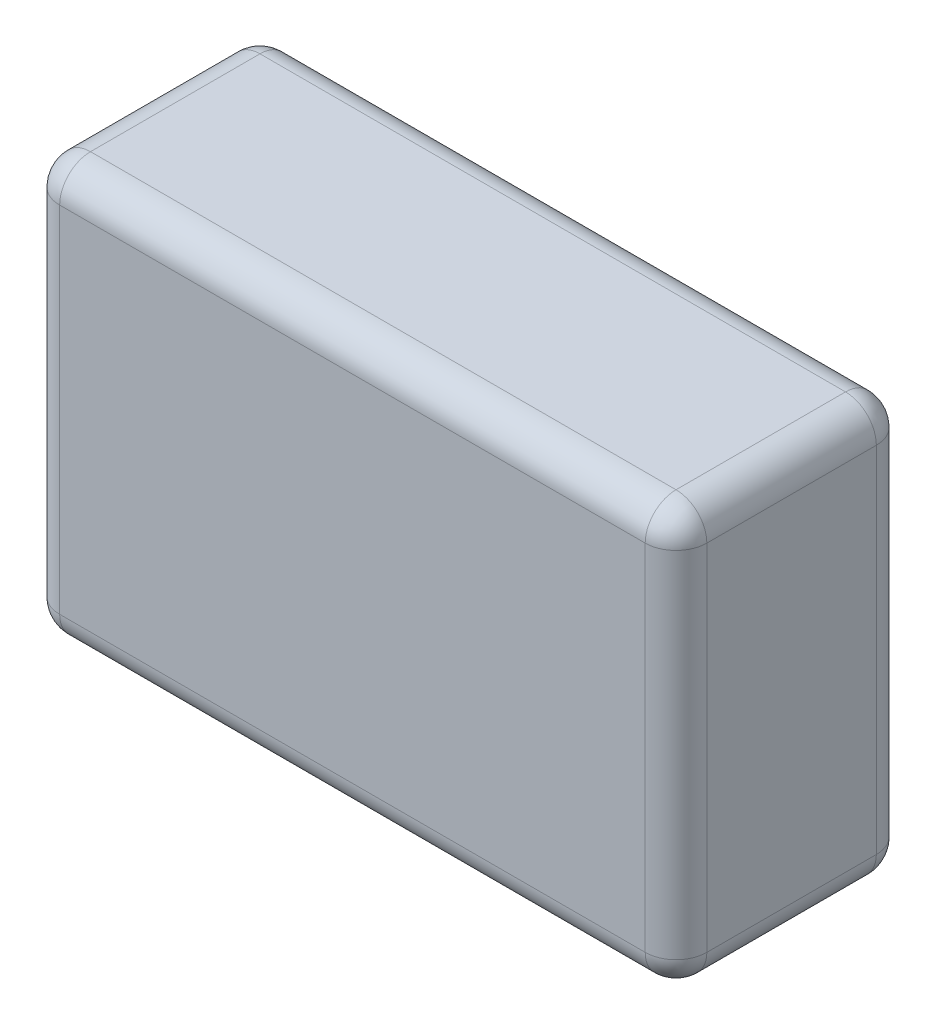
ISO-10303-21;
HEADER;
FILE_DESCRIPTION(('STEP AP214'),'2;1');
FILE_NAME('part.step','',(''),(''),'','','');
FILE_SCHEMA(('AUTOMOTIVE_DESIGN { 1 0 10303 214 1 1 1 1 }'));
ENDSEC;
DATA;
#1=APPLICATION_CONTEXT('core data for automotive mechanical design processes');
#2=APPLICATION_PROTOCOL_DEFINITION('international standard','automotive_design',2000,#1);
#3=PRODUCT_CONTEXT('',#1,'mechanical');
#4=PRODUCT('Part','Part','',(#3));
#5=PRODUCT_RELATED_PRODUCT_CATEGORY('part','',(#4));
#6=PRODUCT_DEFINITION_FORMATION('','',#4);
#7=PRODUCT_DEFINITION_CONTEXT('part definition',#1,'design');
#8=PRODUCT_DEFINITION('design','',#6,#7);
#9=PRODUCT_DEFINITION_SHAPE('','',#8);
#10=(LENGTH_UNIT() NAMED_UNIT(*) SI_UNIT(.MILLI.,.METRE.));
#11=(NAMED_UNIT(*) PLANE_ANGLE_UNIT() SI_UNIT($,.RADIAN.));
#12=(NAMED_UNIT(*) SI_UNIT($,.STERADIAN.) SOLID_ANGLE_UNIT());
#13=UNCERTAINTY_MEASURE_WITH_UNIT(LENGTH_MEASURE(1.E-05),#10,'distance_accuracy_value','');
#14=(GEOMETRIC_REPRESENTATION_CONTEXT(3) GLOBAL_UNCERTAINTY_ASSIGNED_CONTEXT((#13)) GLOBAL_UNIT_ASSIGNED_CONTEXT((#10,
#11,#12)) REPRESENTATION_CONTEXT('',''));
#15=CARTESIAN_POINT('',(0.,0.,0.));
#16=DIRECTION('',(0.,0.,1.));
#17=DIRECTION('',(1.,0.,0.));
#18=AXIS2_PLACEMENT_3D('',#15,#16,#17);
#19=CARTESIAN_POINT('',(0.95,-0.975,0.1));
#20=DIRECTION('',(0.,-1.,0.));
#21=DIRECTION('',(0.,0.,-1.));
#22=AXIS2_PLACEMENT_3D('',#19,#20,#21);
#23=CYLINDRICAL_SURFACE('',#22,0.1);
#24=DIRECTION('',(0.,1.,0.));
#25=VECTOR('',#24,1.);
#26=CARTESIAN_POINT('',(0.95,-0.675,0.));
#27=LINE('',#26,#25);
#28=CARTESIAN_POINT('',(0.95,0.575000000050173,0.));
#29=VERTEX_POINT('',#28);
#30=CARTESIAN_POINT('',(0.95,-0.575,0.));
#31=VERTEX_POINT('',#30);
#32=EDGE_CURVE('E120',#29,#31,#27,.F.);
#33=ORIENTED_EDGE('',*,*,#32,.F.);
#34=CARTESIAN_POINT('',(0.95,0.575,0.1));
#35=DIRECTION('',(0.,1.,0.));
#36=DIRECTION('',(1.,0.,0.));
#37=AXIS2_PLACEMENT_3D('',#34,#35,#36);
#38=CIRCLE('',#37,0.0999999999999999);
#39=CARTESIAN_POINT('',(1.05,0.575,0.1));
#40=VERTEX_POINT('',#39);
#41=EDGE_CURVE('E237',#40,#29,#38,.T.);
#42=ORIENTED_EDGE('',*,*,#41,.F.);
#43=DIRECTION('',(0.,1.,0.));
#44=VECTOR('',#43,1.);
#45=CARTESIAN_POINT('',(1.05,-0.675,0.1));
#46=LINE('',#45,#44);
#47=CARTESIAN_POINT('',(1.05,-0.575,0.1));
#48=VERTEX_POINT('',#47);
#49=EDGE_CURVE('E123',#48,#40,#46,.T.);
#50=ORIENTED_EDGE('',*,*,#49,.F.);
#51=CARTESIAN_POINT('',(0.95,-0.575,0.1));
#52=DIRECTION('',(0.,1.,0.));
#53=DIRECTION('',(1.,0.,0.));
#54=AXIS2_PLACEMENT_3D('',#51,#52,#53);
#55=CIRCLE('',#54,0.1);
#56=EDGE_CURVE('E119',#31,#48,#55,.F.);
#57=ORIENTED_EDGE('',*,*,#56,.F.);
#58=EDGE_LOOP('',(#33,#42,#50,#57));
#59=FACE_BOUND('',#58,.T.);
#60=ADVANCED_FACE('F16',(#59),#23,.T.);
#61=CARTESIAN_POINT('',(0.95,0.575,0.1));
#62=DIRECTION('',(0.,1.,0.));
#63=DIRECTION('',(1.,0.,0.));
#64=AXIS2_PLACEMENT_3D('',#61,#62,#63);
#65=SPHERICAL_SURFACE('',#64,0.1);
#66=CARTESIAN_POINT('',(0.95,0.575,0.1));
#67=DIRECTION('',(-1.,0.,0.));
#68=DIRECTION('',(0.,0.,1.));
#69=AXIS2_PLACEMENT_3D('',#66,#67,#68);
#70=CIRCLE('',#69,0.1);
#71=CARTESIAN_POINT('',(0.95,0.675,0.1));
#72=VERTEX_POINT('',#71);
#73=EDGE_CURVE('E185',#72,#29,#70,.T.);
#74=ORIENTED_EDGE('',*,*,#73,.F.);
#75=CARTESIAN_POINT('',(0.95,0.575,0.1));
#76=DIRECTION('',(0.,0.,-1.));
#77=DIRECTION('',(-1.,0.,0.));
#78=AXIS2_PLACEMENT_3D('',#75,#76,#77);
#79=CIRCLE('',#78,0.1);
#80=EDGE_CURVE('E192',#40,#72,#79,.F.);
#81=ORIENTED_EDGE('',*,*,#80,.F.);
#82=ORIENTED_EDGE('',*,*,#41,.T.);
#83=EDGE_LOOP('',(#74,#81,#82));
#84=FACE_BOUND('',#83,.T.);
#85=ADVANCED_FACE('F246',(#84),#65,.T.);
#86=CARTESIAN_POINT('',(-0.95,0.575,0.1));
#87=DIRECTION('',(-1.,0.,0.));
#88=DIRECTION('',(0.,1.,0.));
#89=AXIS2_PLACEMENT_3D('',#86,#87,#88);
#90=SPHERICAL_SURFACE('',#89,0.1);
#91=CARTESIAN_POINT('',(-0.95,0.575,0.1));
#92=DIRECTION('',(0.,-1.,0.));
#93=DIRECTION('',(0.,0.,-1.));
#94=AXIS2_PLACEMENT_3D('',#91,#92,#93);
#95=CIRCLE('',#94,0.1);
#96=CARTESIAN_POINT('',(-1.05,0.575,0.1));
#97=VERTEX_POINT('',#96);
#98=CARTESIAN_POINT('',(-0.95,0.575000000100311,0.));
#99=VERTEX_POINT('',#98);
#100=EDGE_CURVE('E132',#97,#99,#95,.T.);
#101=ORIENTED_EDGE('',*,*,#100,.F.);
#102=CARTESIAN_POINT('',(-0.95,0.575,0.1));
#103=DIRECTION('',(0.,0.,1.));
#104=DIRECTION('',(1.,0.,0.));
#105=AXIS2_PLACEMENT_3D('',#102,#103,#104);
#106=CIRCLE('',#105,0.1);
#107=CARTESIAN_POINT('',(-0.95,0.675,0.100000000194307));
#108=VERTEX_POINT('',#107);
#109=EDGE_CURVE('E177',#108,#97,#106,.T.);
#110=ORIENTED_EDGE('',*,*,#109,.F.);
#111=CARTESIAN_POINT('',(-0.95,0.575,0.0999999999999999));
#112=DIRECTION('',(-1.,0.,0.));
#113=DIRECTION('',(0.,0.,1.));
#114=AXIS2_PLACEMENT_3D('',#111,#112,#113);
#115=CIRCLE('',#114,0.1);
#116=EDGE_CURVE('E182',#99,#108,#115,.F.);
#117=ORIENTED_EDGE('',*,*,#116,.F.);
#118=EDGE_LOOP('',(#101,#110,#117));
#119=FACE_BOUND('',#118,.T.);
#120=ADVANCED_FACE('F244',(#119),#90,.T.);
#121=CARTESIAN_POINT('',(-0.95,-0.975,0.1));
#122=DIRECTION('',(0.,-1.,0.));
#123=DIRECTION('',(0.,0.,-1.));
#124=AXIS2_PLACEMENT_3D('',#121,#122,#123);
#125=CYLINDRICAL_SURFACE('',#124,0.1);
#126=DIRECTION('',(0.,1.,0.));
#127=VECTOR('',#126,1.);
#128=CARTESIAN_POINT('',(-1.05,-0.675,0.1));
#129=LINE('',#128,#127);
#130=CARTESIAN_POINT('',(-1.05,-0.575,0.1));
#131=VERTEX_POINT('',#130);
#132=EDGE_CURVE('E174',#97,#131,#129,.F.);
#133=ORIENTED_EDGE('',*,*,#132,.F.);
#134=ORIENTED_EDGE('',*,*,#100,.T.);
#135=DIRECTION('',(0.,1.,0.));
#136=VECTOR('',#135,1.);
#137=CARTESIAN_POINT('',(-0.95,-0.675,0.));
#138=LINE('',#137,#136);
#139=CARTESIAN_POINT('',(-0.95,-0.575000000100196,0.));
#140=VERTEX_POINT('',#139);
#141=EDGE_CURVE('E101',#140,#99,#138,.T.);
#142=ORIENTED_EDGE('',*,*,#141,.F.);
#143=CARTESIAN_POINT('',(-0.95,-0.575,0.0999999999999999));
#144=DIRECTION('',(0.,-1.,0.));
#145=DIRECTION('',(-1.,0.,0.));
#146=AXIS2_PLACEMENT_3D('',#143,#144,#145);
#147=CIRCLE('',#146,0.0999999999999999);
#148=EDGE_CURVE('E207',#131,#140,#147,.T.);
#149=ORIENTED_EDGE('',*,*,#148,.F.);
#150=EDGE_LOOP('',(#133,#134,#142,#149));
#151=FACE_BOUND('',#150,.T.);
#152=ADVANCED_FACE('F222',(#151),#125,.T.);
#153=CARTESIAN_POINT('',(0.95,-0.575,0.1));
#154=DIRECTION('',(1.,0.,0.));
#155=DIRECTION('',(0.,-1.,0.));
#156=AXIS2_PLACEMENT_3D('',#153,#154,#155);
#157=SPHERICAL_SURFACE('',#156,0.1);
#158=CARTESIAN_POINT('',(0.95,-0.575,0.1));
#159=DIRECTION('',(1.,0.,0.));
#160=DIRECTION('',(0.,0.,-1.));
#161=AXIS2_PLACEMENT_3D('',#158,#159,#160);
#162=CIRCLE('',#161,0.1);
#163=CARTESIAN_POINT('',(0.95,-0.675,0.1));
#164=VERTEX_POINT('',#163);
#165=EDGE_CURVE('E112',#31,#164,#162,.F.);
#166=ORIENTED_EDGE('',*,*,#165,.F.);
#167=ORIENTED_EDGE('',*,*,#56,.T.);
#168=CARTESIAN_POINT('',(0.95,-0.575,0.1));
#169=DIRECTION('',(0.,0.,1.));
#170=DIRECTION('',(1.,0.,0.));
#171=AXIS2_PLACEMENT_3D('',#168,#169,#170);
#172=CIRCLE('',#171,0.1);
#173=EDGE_CURVE('E136',#164,#48,#172,.T.);
#174=ORIENTED_EDGE('',*,*,#173,.F.);
#175=EDGE_LOOP('',(#166,#167,#174));
#176=FACE_BOUND('',#175,.T.);
#177=ADVANCED_FACE('F134',(#176),#157,.T.);
#178=CARTESIAN_POINT('',(1.05,-0.675,0.));
#179=DIRECTION('',(0.,0.,-1.));
#180=DIRECTION('',(-1.,0.,0.));
#181=AXIS2_PLACEMENT_3D('',#178,#179,#180);
#182=PLANE('',#181);
#183=ORIENTED_EDGE('',*,*,#32,.T.);
#184=DIRECTION('',(-1.,0.,0.));
#185=VECTOR('',#184,1.);
#186=CARTESIAN_POINT('',(1.05,-0.575000000200392,0.));
#187=LINE('',#186,#185);
#188=EDGE_CURVE('E19',#140,#31,#187,.F.);
#189=ORIENTED_EDGE('',*,*,#188,.F.);
#190=ORIENTED_EDGE('',*,*,#141,.T.);
#191=DIRECTION('',(-1.,0.,0.));
#192=VECTOR('',#191,1.);
#193=CARTESIAN_POINT('',(1.35,0.575,0.));
#194=LINE('',#193,#192);
#195=EDGE_CURVE('E130',#29,#99,#194,.T.);
#196=ORIENTED_EDGE('',*,*,#195,.F.);
#197=EDGE_LOOP('',(#183,#189,#190,#196));
#198=FACE_BOUND('',#197,.T.);
#199=ADVANCED_FACE('F129',(#198),#182,.T.);
#200=CARTESIAN_POINT('',(-0.95,-0.575,0.0999999999999999));
#201=DIRECTION('',(0.,-1.,0.));
#202=DIRECTION('',(-1.,0.,0.));
#203=AXIS2_PLACEMENT_3D('',#200,#201,#202);
#204=SPHERICAL_SURFACE('',#203,0.1);
#205=CARTESIAN_POINT('',(-0.95,-0.575,0.1));
#206=DIRECTION('',(0.,0.,-1.));
#207=DIRECTION('',(-1.,0.,0.));
#208=AXIS2_PLACEMENT_3D('',#205,#206,#207);
#209=CIRCLE('',#208,0.1);
#210=CARTESIAN_POINT('',(-0.95,-0.675,0.100000000300902));
#211=VERTEX_POINT('',#210);
#212=EDGE_CURVE('E116',#131,#211,#209,.F.);
#213=ORIENTED_EDGE('',*,*,#212,.F.);
#214=ORIENTED_EDGE('',*,*,#148,.T.);
#215=CARTESIAN_POINT('',(-0.95,-0.575,0.0999999999999999));
#216=DIRECTION('',(1.,0.,0.));
#217=DIRECTION('',(0.,0.,-1.));
#218=AXIS2_PLACEMENT_3D('',#215,#216,#217);
#219=CIRCLE('',#218,0.1);
#220=EDGE_CURVE('E113',#211,#140,#219,.T.);
#221=ORIENTED_EDGE('',*,*,#220,.F.);
#222=EDGE_LOOP('',(#213,#214,#221));
#223=FACE_BOUND('',#222,.T.);
#224=ADVANCED_FACE('F210',(#223),#204,.T.);
#225=CARTESIAN_POINT('',(1.05,-0.675,0.75));
#226=DIRECTION('',(1.,0.,0.));
#227=DIRECTION('',(0.,0.,-1.));
#228=AXIS2_PLACEMENT_3D('',#225,#226,#227);
#229=PLANE('',#228);
#230=DIRECTION('',(0.,-1.,0.));
#231=VECTOR('',#230,1.);
#232=CARTESIAN_POINT('',(1.05,-0.975,0.65));
#233=LINE('',#232,#231);
#234=CARTESIAN_POINT('',(1.05,-0.575,0.65));
#235=VERTEX_POINT('',#234);
#236=CARTESIAN_POINT('',(1.05,0.575,0.65));
#237=VERTEX_POINT('',#236);
#238=EDGE_CURVE('E151',#235,#237,#233,.F.);
#239=ORIENTED_EDGE('',*,*,#238,.F.);
#240=DIRECTION('',(0.,0.,1.));
#241=VECTOR('',#240,1.);
#242=CARTESIAN_POINT('',(1.05,-0.575,1.15));
#243=LINE('',#242,#241);
#244=EDGE_CURVE('E138',#48,#235,#243,.T.);
#245=ORIENTED_EDGE('',*,*,#244,.F.);
#246=ORIENTED_EDGE('',*,*,#49,.T.);
#247=DIRECTION('',(0.,0.,-1.));
#248=VECTOR('',#247,1.);
#249=CARTESIAN_POINT('',(1.05,0.575,1.15));
#250=LINE('',#249,#248);
#251=EDGE_CURVE('E186',#237,#40,#250,.T.);
#252=ORIENTED_EDGE('',*,*,#251,.F.);
#253=EDGE_LOOP('',(#239,#245,#246,#252));
#254=FACE_BOUND('',#253,.T.);
#255=ADVANCED_FACE('F214',(#254),#229,.T.);
#256=CARTESIAN_POINT('',(0.95,0.575,1.15));
#257=DIRECTION('',(0.,0.,-1.));
#258=DIRECTION('',(-1.,0.,0.));
#259=AXIS2_PLACEMENT_3D('',#256,#257,#258);
#260=CYLINDRICAL_SURFACE('',#259,0.1);
#261=CARTESIAN_POINT('',(0.95,0.575,0.65));
#262=DIRECTION('',(0.,0.,1.));
#263=DIRECTION('',(1.,0.,0.));
#264=AXIS2_PLACEMENT_3D('',#261,#262,#263);
#265=CIRCLE('',#264,0.1);
#266=CARTESIAN_POINT('',(0.95,0.675,0.65));
#267=VERTEX_POINT('',#266);
#268=EDGE_CURVE('E165',#237,#267,#265,.T.);
#269=ORIENTED_EDGE('',*,*,#268,.F.);
#270=ORIENTED_EDGE('',*,*,#251,.T.);
#271=ORIENTED_EDGE('',*,*,#80,.T.);
#272=DIRECTION('',(0.,0.,1.));
#273=VECTOR('',#272,1.);
#274=CARTESIAN_POINT('',(0.95,0.675,0.));
#275=LINE('',#274,#273);
#276=EDGE_CURVE('E366',#267,#72,#275,.F.);
#277=ORIENTED_EDGE('',*,*,#276,.F.);
#278=EDGE_LOOP('',(#269,#270,#271,#277));
#279=FACE_BOUND('',#278,.T.);
#280=ADVANCED_FACE('F429',(#279),#260,.T.);
#281=CARTESIAN_POINT('',(1.35,0.575,0.1));
#282=DIRECTION('',(-1.,0.,0.));
#283=DIRECTION('',(0.,0.,1.));
#284=AXIS2_PLACEMENT_3D('',#281,#282,#283);
#285=CYLINDRICAL_SURFACE('',#284,0.1);
#286=ORIENTED_EDGE('',*,*,#73,.T.);
#287=ORIENTED_EDGE('',*,*,#195,.T.);
#288=ORIENTED_EDGE('',*,*,#116,.T.);
#289=DIRECTION('',(1.,0.,0.));
#290=VECTOR('',#289,1.);
#291=CARTESIAN_POINT('',(0.,0.675,0.100000000388613));
#292=LINE('',#291,#290);
#293=EDGE_CURVE('E416',#72,#108,#292,.F.);
#294=ORIENTED_EDGE('',*,*,#293,.F.);
#295=EDGE_LOOP('',(#286,#287,#288,#294));
#296=FACE_BOUND('',#295,.T.);
#297=ADVANCED_FACE('F495',(#296),#285,.T.);
#298=CARTESIAN_POINT('',(-0.95,0.575,-0.4));
#299=DIRECTION('',(0.,0.,1.));
#300=DIRECTION('',(1.,0.,0.));
#301=AXIS2_PLACEMENT_3D('',#298,#299,#300);
#302=CYLINDRICAL_SURFACE('',#301,0.1);
#303=CARTESIAN_POINT('',(-0.95,0.575,0.65));
#304=DIRECTION('',(0.,0.,1.));
#305=DIRECTION('',(0.,1.,0.));
#306=AXIS2_PLACEMENT_3D('',#303,#304,#305);
#307=CIRCLE('',#306,0.1);
#308=CARTESIAN_POINT('',(-0.95,0.675,0.64999999979941));
#309=VERTEX_POINT('',#308);
#310=CARTESIAN_POINT('',(-1.05,0.575,0.65));
#311=VERTEX_POINT('',#310);
#312=EDGE_CURVE('E158',#309,#311,#307,.T.);
#313=ORIENTED_EDGE('',*,*,#312,.F.);
#314=DIRECTION('',(0.,0.,1.));
#315=VECTOR('',#314,1.);
#316=CARTESIAN_POINT('',(-0.95,0.675,0.));
#317=LINE('',#316,#315);
#318=EDGE_CURVE('E419',#108,#309,#317,.T.);
#319=ORIENTED_EDGE('',*,*,#318,.F.);
#320=ORIENTED_EDGE('',*,*,#109,.T.);
#321=DIRECTION('',(0.,0.,1.));
#322=VECTOR('',#321,1.);
#323=CARTESIAN_POINT('',(-1.05,0.575,0.));
#324=LINE('',#323,#322);
#325=EDGE_CURVE('E169',#311,#97,#324,.F.);
#326=ORIENTED_EDGE('',*,*,#325,.F.);
#327=EDGE_LOOP('',(#313,#319,#320,#326));
#328=FACE_BOUND('',#327,.T.);
#329=ADVANCED_FACE('F487',(#328),#302,.T.);
#330=CARTESIAN_POINT('',(-1.05,-0.675,0.));
#331=DIRECTION('',(-1.,0.,0.));
#332=DIRECTION('',(0.,0.,1.));
#333=AXIS2_PLACEMENT_3D('',#330,#331,#332);
#334=PLANE('',#333);
#335=DIRECTION('',(0.,-1.,0.));
#336=VECTOR('',#335,1.);
#337=CARTESIAN_POINT('',(-1.05,-0.975,0.65));
#338=LINE('',#337,#336);
#339=CARTESIAN_POINT('',(-1.05,-0.575,0.65));
#340=VERTEX_POINT('',#339);
#341=EDGE_CURVE('E154',#311,#340,#338,.T.);
#342=ORIENTED_EDGE('',*,*,#341,.F.);
#343=ORIENTED_EDGE('',*,*,#325,.T.);
#344=ORIENTED_EDGE('',*,*,#132,.T.);
#345=DIRECTION('',(0.,0.,-1.));
#346=VECTOR('',#345,1.);
#347=CARTESIAN_POINT('',(-1.05,-0.575,-0.4));
#348=LINE('',#347,#346);
#349=EDGE_CURVE('E148',#340,#131,#348,.T.);
#350=ORIENTED_EDGE('',*,*,#349,.F.);
#351=EDGE_LOOP('',(#342,#343,#344,#350));
#352=FACE_BOUND('',#351,.T.);
#353=ADVANCED_FACE('F480',(#352),#334,.T.);
#354=CARTESIAN_POINT('',(0.95,-0.575,1.15));
#355=DIRECTION('',(0.,0.,1.));
#356=DIRECTION('',(1.,0.,0.));
#357=AXIS2_PLACEMENT_3D('',#354,#355,#356);
#358=CYLINDRICAL_SURFACE('',#357,0.1);
#359=CARTESIAN_POINT('',(0.95,-0.575,0.65));
#360=DIRECTION('',(0.,0.,1.));
#361=DIRECTION('',(0.,-1.,0.));
#362=AXIS2_PLACEMENT_3D('',#359,#360,#361);
#363=CIRCLE('',#362,0.1);
#364=CARTESIAN_POINT('',(0.95,-0.675,0.64999999971596));
#365=VERTEX_POINT('',#364);
#366=EDGE_CURVE('E291',#365,#235,#363,.T.);
#367=ORIENTED_EDGE('',*,*,#366,.F.);
#368=DIRECTION('',(0.,0.,1.));
#369=VECTOR('',#368,1.);
#370=CARTESIAN_POINT('',(0.95,-0.675,0.));
#371=LINE('',#370,#369);
#372=EDGE_CURVE('E315',#365,#164,#371,.F.);
#373=ORIENTED_EDGE('',*,*,#372,.T.);
#374=ORIENTED_EDGE('',*,*,#173,.T.);
#375=ORIENTED_EDGE('',*,*,#244,.T.);
#376=EDGE_LOOP('',(#367,#373,#374,#375));
#377=FACE_BOUND('',#376,.T.);
#378=ADVANCED_FACE('F435',(#377),#358,.T.);
#379=CARTESIAN_POINT('',(1.35,-0.575,0.1));
#380=DIRECTION('',(1.,0.,0.));
#381=DIRECTION('',(0.,0.,-1.));
#382=AXIS2_PLACEMENT_3D('',#379,#380,#381);
#383=CYLINDRICAL_SURFACE('',#382,0.1);
#384=ORIENTED_EDGE('',*,*,#220,.T.);
#385=ORIENTED_EDGE('',*,*,#188,.T.);
#386=ORIENTED_EDGE('',*,*,#165,.T.);
#387=DIRECTION('',(1.,0.,0.));
#388=VECTOR('',#387,1.);
#389=CARTESIAN_POINT('',(0.,-0.675,0.100000000401202));
#390=LINE('',#389,#388);
#391=EDGE_CURVE('E295',#164,#211,#390,.F.);
#392=ORIENTED_EDGE('',*,*,#391,.T.);
#393=EDGE_LOOP('',(#384,#385,#386,#392));
#394=FACE_BOUND('',#393,.T.);
#395=ADVANCED_FACE('F109',(#394),#383,.T.);
#396=CARTESIAN_POINT('',(-0.95,-0.575,-0.4));
#397=DIRECTION('',(0.,0.,-1.));
#398=DIRECTION('',(-1.,0.,0.));
#399=AXIS2_PLACEMENT_3D('',#396,#397,#398);
#400=CYLINDRICAL_SURFACE('',#399,0.1);
#401=CARTESIAN_POINT('',(-0.95,-0.575,0.65));
#402=DIRECTION('',(0.,0.,1.));
#403=DIRECTION('',(-1.,0.,0.));
#404=AXIS2_PLACEMENT_3D('',#401,#402,#403);
#405=CIRCLE('',#404,0.1);
#406=CARTESIAN_POINT('',(-0.95,-0.675,0.65));
#407=VERTEX_POINT('',#406);
#408=EDGE_CURVE('E290',#340,#407,#405,.T.);
#409=ORIENTED_EDGE('',*,*,#408,.F.);
#410=ORIENTED_EDGE('',*,*,#349,.T.);
#411=ORIENTED_EDGE('',*,*,#212,.T.);
#412=DIRECTION('',(0.,0.,1.));
#413=VECTOR('',#412,1.);
#414=CARTESIAN_POINT('',(-0.95,-0.675,0.));
#415=LINE('',#414,#413);
#416=EDGE_CURVE('E33',#211,#407,#415,.T.);
#417=ORIENTED_EDGE('',*,*,#416,.T.);
#418=EDGE_LOOP('',(#409,#410,#411,#417));
#419=FACE_BOUND('',#418,.T.);
#420=ADVANCED_FACE('F372',(#419),#400,.T.);
#421=CARTESIAN_POINT('',(0.95,-0.975,0.65));
#422=DIRECTION('',(0.,-1.,0.));
#423=DIRECTION('',(0.,0.,-1.));
#424=AXIS2_PLACEMENT_3D('',#421,#422,#423);
#425=CYLINDRICAL_SURFACE('',#424,0.1);
#426=ORIENTED_EDGE('',*,*,#238,.T.);
#427=CARTESIAN_POINT('',(0.95,0.575,0.65));
#428=DIRECTION('',(0.,-1.,0.));
#429=DIRECTION('',(1.,0.,0.));
#430=AXIS2_PLACEMENT_3D('',#427,#428,#429);
#431=CIRCLE('',#430,0.1);
#432=CARTESIAN_POINT('',(0.95,0.575000000100311,0.75));
#433=VERTEX_POINT('',#432);
#434=EDGE_CURVE('E361',#433,#237,#431,.F.);
#435=ORIENTED_EDGE('',*,*,#434,.F.);
#436=DIRECTION('',(0.,1.,0.));
#437=VECTOR('',#436,1.);
#438=CARTESIAN_POINT('',(0.95,-0.675,0.75));
#439=LINE('',#438,#437);
#440=CARTESIAN_POINT('',(0.95,-0.575000000100457,0.75));
#441=VERTEX_POINT('',#440);
#442=EDGE_CURVE('E305',#441,#433,#439,.T.);
#443=ORIENTED_EDGE('',*,*,#442,.F.);
#444=CARTESIAN_POINT('',(0.95,-0.575,0.65));
#445=DIRECTION('',(0.,-1.,0.));
#446=DIRECTION('',(1.,0.,0.));
#447=AXIS2_PLACEMENT_3D('',#444,#445,#446);
#448=CIRCLE('',#447,0.0999999999999999);
#449=EDGE_CURVE('E312',#235,#441,#448,.T.);
#450=ORIENTED_EDGE('',*,*,#449,.F.);
#451=EDGE_LOOP('',(#426,#435,#443,#450));
#452=FACE_BOUND('',#451,.T.);
#453=ADVANCED_FACE('F351',(#452),#425,.T.);
#454=CARTESIAN_POINT('',(0.95,0.575,0.65));
#455=DIRECTION('',(1.,0.,0.));
#456=DIRECTION('',(0.,1.,0.));
#457=AXIS2_PLACEMENT_3D('',#454,#455,#456);
#458=SPHERICAL_SURFACE('',#457,0.1);
#459=CARTESIAN_POINT('',(0.95,0.575,0.65));
#460=DIRECTION('',(1.,0.,0.));
#461=DIRECTION('',(0.,0.,-1.));
#462=AXIS2_PLACEMENT_3D('',#459,#460,#461);
#463=CIRCLE('',#462,0.1);
#464=EDGE_CURVE('E308',#433,#267,#463,.F.);
#465=ORIENTED_EDGE('',*,*,#464,.F.);
#466=ORIENTED_EDGE('',*,*,#434,.T.);
#467=ORIENTED_EDGE('',*,*,#268,.T.);
#468=EDGE_LOOP('',(#465,#466,#467));
#469=FACE_BOUND('',#468,.T.);
#470=ADVANCED_FACE('F346',(#469),#458,.T.);
#471=CARTESIAN_POINT('',(0.,0.675,0.));
#472=DIRECTION('',(0.,1.,0.));
#473=DIRECTION('',(0.,0.,1.));
#474=AXIS2_PLACEMENT_3D('',#471,#472,#473);
#475=PLANE('',#474);
#476=ORIENTED_EDGE('',*,*,#318,.T.);
#477=DIRECTION('',(1.,0.,0.));
#478=VECTOR('',#477,1.);
#479=CARTESIAN_POINT('',(-1.35,0.675,0.64999999959882));
#480=LINE('',#479,#478);
#481=EDGE_CURVE('E331',#267,#309,#480,.F.);
#482=ORIENTED_EDGE('',*,*,#481,.F.);
#483=ORIENTED_EDGE('',*,*,#276,.T.);
#484=ORIENTED_EDGE('',*,*,#293,.T.);
#485=EDGE_LOOP('',(#476,#482,#483,#484));
#486=FACE_BOUND('',#485,.T.);
#487=ADVANCED_FACE('F342',(#486),#475,.T.);
#488=CARTESIAN_POINT('',(-0.95,0.575,0.65));
#489=DIRECTION('',(0.,1.,0.));
#490=DIRECTION('',(-1.,0.,0.));
#491=AXIS2_PLACEMENT_3D('',#488,#489,#490);
#492=SPHERICAL_SURFACE('',#491,0.1);
#493=CARTESIAN_POINT('',(-0.95,0.575,0.65));
#494=DIRECTION('',(0.,-1.,0.));
#495=DIRECTION('',(0.,0.,-1.));
#496=AXIS2_PLACEMENT_3D('',#493,#494,#495);
#497=CIRCLE('',#496,0.1);
#498=CARTESIAN_POINT('',(-0.95,0.575000000100347,0.75));
#499=VERTEX_POINT('',#498);
#500=EDGE_CURVE('E157',#499,#311,#497,.T.);
#501=ORIENTED_EDGE('',*,*,#500,.F.);
#502=CARTESIAN_POINT('',(-0.95,0.575,0.65));
#503=DIRECTION('',(1.,0.,0.));
#504=DIRECTION('',(0.,0.,-1.));
#505=AXIS2_PLACEMENT_3D('',#502,#503,#504);
#506=CIRCLE('',#505,0.1);
#507=EDGE_CURVE('E302',#309,#499,#506,.T.);
#508=ORIENTED_EDGE('',*,*,#507,.F.);
#509=ORIENTED_EDGE('',*,*,#312,.T.);
#510=EDGE_LOOP('',(#501,#508,#509));
#511=FACE_BOUND('',#510,.T.);
#512=ADVANCED_FACE('F338',(#511),#492,.T.);
#513=CARTESIAN_POINT('',(-0.95,-0.975,0.65));
#514=DIRECTION('',(0.,-1.,0.));
#515=DIRECTION('',(0.,0.,-1.));
#516=AXIS2_PLACEMENT_3D('',#513,#514,#515);
#517=CYLINDRICAL_SURFACE('',#516,0.1);
#518=DIRECTION('',(0.,1.,0.));
#519=VECTOR('',#518,1.);
#520=CARTESIAN_POINT('',(-0.95,-0.675,0.75));
#521=LINE('',#520,#519);
#522=CARTESIAN_POINT('',(-0.95,-0.575,0.75));
#523=VERTEX_POINT('',#522);
#524=EDGE_CURVE('E298',#499,#523,#521,.F.);
#525=ORIENTED_EDGE('',*,*,#524,.F.);
#526=ORIENTED_EDGE('',*,*,#500,.T.);
#527=ORIENTED_EDGE('',*,*,#341,.T.);
#528=CARTESIAN_POINT('',(-0.95,-0.575,0.65));
#529=DIRECTION('',(0.,1.,0.));
#530=DIRECTION('',(-1.,0.,0.));
#531=AXIS2_PLACEMENT_3D('',#528,#529,#530);
#532=CIRCLE('',#531,0.1);
#533=EDGE_CURVE('E287',#523,#340,#532,.F.);
#534=ORIENTED_EDGE('',*,*,#533,.F.);
#535=EDGE_LOOP('',(#525,#526,#527,#534));
#536=FACE_BOUND('',#535,.T.);
#537=ADVANCED_FACE('F341',(#536),#517,.T.);
#538=CARTESIAN_POINT('',(0.95,-0.575,0.65));
#539=DIRECTION('',(0.,-1.,0.));
#540=DIRECTION('',(1.,0.,0.));
#541=AXIS2_PLACEMENT_3D('',#538,#539,#540);
#542=SPHERICAL_SURFACE('',#541,0.1);
#543=CARTESIAN_POINT('',(0.95,-0.575,0.65));
#544=DIRECTION('',(-1.,0.,0.));
#545=DIRECTION('',(0.,0.,1.));
#546=AXIS2_PLACEMENT_3D('',#543,#544,#545);
#547=CIRCLE('',#546,0.1);
#548=EDGE_CURVE('E301',#365,#441,#547,.T.);
#549=ORIENTED_EDGE('',*,*,#548,.F.);
#550=ORIENTED_EDGE('',*,*,#366,.T.);
#551=ORIENTED_EDGE('',*,*,#449,.T.);
#552=EDGE_LOOP('',(#549,#550,#551));
#553=FACE_BOUND('',#552,.T.);
#554=ADVANCED_FACE('F278',(#553),#542,.T.);
#555=CARTESIAN_POINT('',(-0.95,-0.575,0.65));
#556=DIRECTION('',(-1.,0.,0.));
#557=DIRECTION('',(0.,-1.,0.));
#558=AXIS2_PLACEMENT_3D('',#555,#556,#557);
#559=SPHERICAL_SURFACE('',#558,0.1);
#560=ORIENTED_EDGE('',*,*,#408,.T.);
#561=CARTESIAN_POINT('',(-0.95,-0.575,0.65));
#562=DIRECTION('',(-1.,0.,0.));
#563=DIRECTION('',(0.,0.,1.));
#564=AXIS2_PLACEMENT_3D('',#561,#562,#563);
#565=CIRCLE('',#564,0.1);
#566=EDGE_CURVE('E382',#523,#407,#565,.F.);
#567=ORIENTED_EDGE('',*,*,#566,.F.);
#568=ORIENTED_EDGE('',*,*,#533,.T.);
#569=EDGE_LOOP('',(#560,#567,#568));
#570=FACE_BOUND('',#569,.T.);
#571=ADVANCED_FACE('F273',(#570),#559,.T.);
#572=CARTESIAN_POINT('',(0.,-0.675,0.));
#573=DIRECTION('',(0.,1.,0.));
#574=DIRECTION('',(0.,0.,1.));
#575=AXIS2_PLACEMENT_3D('',#572,#573,#574);
#576=PLANE('',#575);
#577=ORIENTED_EDGE('',*,*,#372,.F.);
#578=DIRECTION('',(-1.,0.,0.));
#579=VECTOR('',#578,1.);
#580=CARTESIAN_POINT('',(-1.35,-0.675,0.65));
#581=LINE('',#580,#579);
#582=EDGE_CURVE('E375',#407,#365,#581,.F.);
#583=ORIENTED_EDGE('',*,*,#582,.F.);
#584=ORIENTED_EDGE('',*,*,#416,.F.);
#585=ORIENTED_EDGE('',*,*,#391,.F.);
#586=EDGE_LOOP('',(#577,#583,#584,#585));
#587=FACE_BOUND('',#586,.T.);
#588=ADVANCED_FACE('F269',(#587),#576,.F.);
#589=CARTESIAN_POINT('',(-1.35,0.575,0.65));
#590=DIRECTION('',(1.,0.,0.));
#591=DIRECTION('',(0.,0.,-1.));
#592=AXIS2_PLACEMENT_3D('',#589,#590,#591);
#593=CYLINDRICAL_SURFACE('',#592,0.1);
#594=ORIENTED_EDGE('',*,*,#507,.T.);
#595=DIRECTION('',(1.,0.,0.));
#596=VECTOR('',#595,1.);
#597=CARTESIAN_POINT('',(-1.05,0.575000000200623,0.75));
#598=LINE('',#597,#596);
#599=EDGE_CURVE('E25',#433,#499,#598,.F.);
#600=ORIENTED_EDGE('',*,*,#599,.F.);
#601=ORIENTED_EDGE('',*,*,#464,.T.);
#602=ORIENTED_EDGE('',*,*,#481,.T.);
#603=EDGE_LOOP('',(#594,#600,#601,#602));
#604=FACE_BOUND('',#603,.T.);
#605=ADVANCED_FACE('F263',(#604),#593,.T.);
#606=CARTESIAN_POINT('',(-1.35,-0.575,0.65));
#607=DIRECTION('',(-1.,0.,0.));
#608=DIRECTION('',(0.,0.,1.));
#609=AXIS2_PLACEMENT_3D('',#606,#607,#608);
#610=CYLINDRICAL_SURFACE('',#609,0.1);
#611=ORIENTED_EDGE('',*,*,#566,.T.);
#612=ORIENTED_EDGE('',*,*,#582,.T.);
#613=ORIENTED_EDGE('',*,*,#548,.T.);
#614=DIRECTION('',(1.,0.,0.));
#615=VECTOR('',#614,1.);
#616=CARTESIAN_POINT('',(-1.05,-0.575000000202494,0.75));
#617=LINE('',#616,#615);
#618=EDGE_CURVE('E11',#523,#441,#617,.T.);
#619=ORIENTED_EDGE('',*,*,#618,.F.);
#620=EDGE_LOOP('',(#611,#612,#613,#619));
#621=FACE_BOUND('',#620,.T.);
#622=ADVANCED_FACE('F257',(#621),#610,.T.);
#623=CARTESIAN_POINT('',(-1.05,-0.675,0.75));
#624=DIRECTION('',(0.,0.,1.));
#625=DIRECTION('',(1.,0.,0.));
#626=AXIS2_PLACEMENT_3D('',#623,#624,#625);
#627=PLANE('',#626);
#628=ORIENTED_EDGE('',*,*,#599,.T.);
#629=ORIENTED_EDGE('',*,*,#524,.T.);
#630=ORIENTED_EDGE('',*,*,#618,.T.);
#631=ORIENTED_EDGE('',*,*,#442,.T.);
#632=EDGE_LOOP('',(#628,#629,#630,#631));
#633=FACE_BOUND('',#632,.T.);
#634=ADVANCED_FACE('F255',(#633),#627,.T.);
#635=CLOSED_SHELL('',(#60,#85,#120,#152,#177,#199,#224,#255,#280,#297,#329,#353,#378,#395,#420,
#453,#470,#487,#512,#537,#554,#571,#588,#605,#622,#634));
#636=MANIFOLD_SOLID_BREP('B1',#635);
#637=ADVANCED_BREP_SHAPE_REPRESENTATION('',(#18,#636),#14);
#638=SHAPE_DEFINITION_REPRESENTATION(#9,#637);
ENDSEC;
END-ISO-10303-21;
